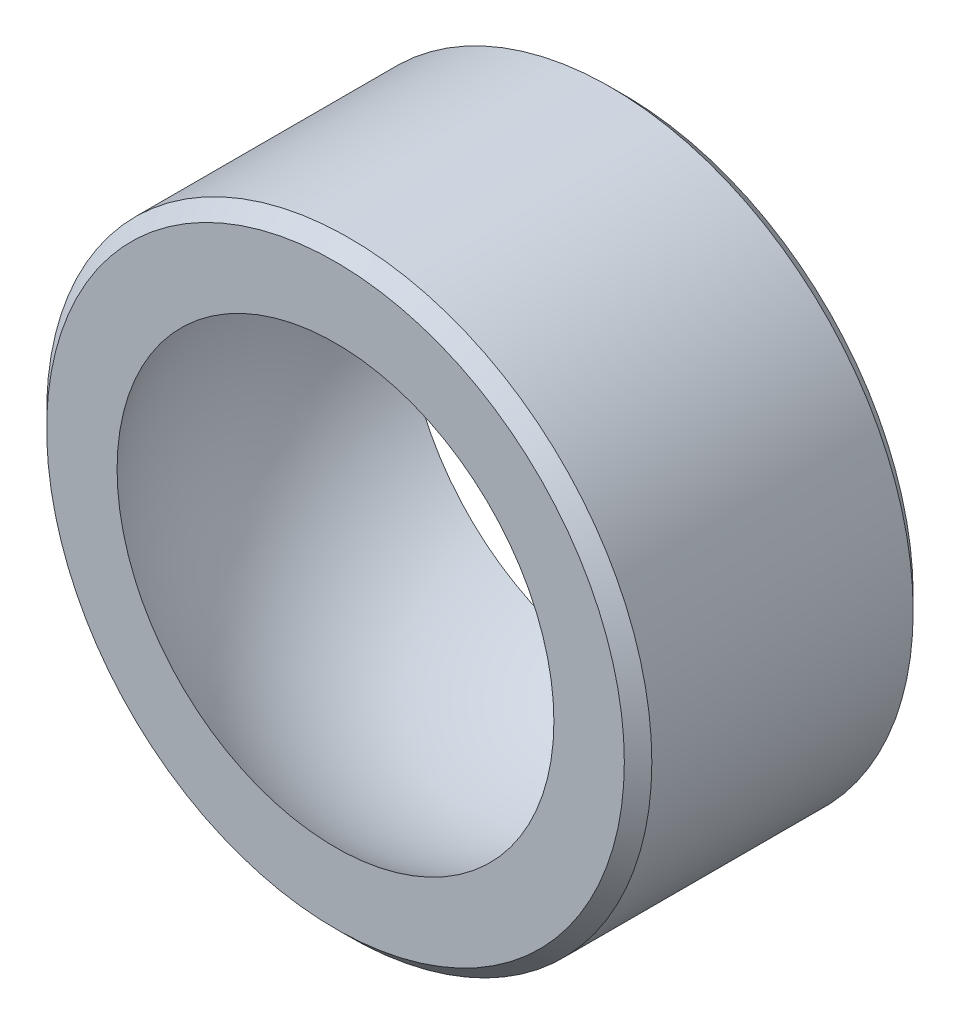
ISO-10303-21;
HEADER;
FILE_DESCRIPTION(('STEP AP214'),'2;1');
FILE_NAME('part.step','',(''),(''),'','','');
FILE_SCHEMA(('AUTOMOTIVE_DESIGN { 1 0 10303 214 1 1 1 1 }'));
ENDSEC;
DATA;
#1=APPLICATION_CONTEXT('core data for automotive mechanical design processes');
#2=APPLICATION_PROTOCOL_DEFINITION('international standard','automotive_design',2000,#1);
#3=PRODUCT_CONTEXT('',#1,'mechanical');
#4=PRODUCT('Part','Part','',(#3));
#5=PRODUCT_RELATED_PRODUCT_CATEGORY('part','',(#4));
#6=PRODUCT_DEFINITION_FORMATION('','',#4);
#7=PRODUCT_DEFINITION_CONTEXT('part definition',#1,'design');
#8=PRODUCT_DEFINITION('design','',#6,#7);
#9=PRODUCT_DEFINITION_SHAPE('','',#8);
#10=(LENGTH_UNIT() NAMED_UNIT(*) SI_UNIT(.MILLI.,.METRE.));
#11=(NAMED_UNIT(*) PLANE_ANGLE_UNIT() SI_UNIT($,.RADIAN.));
#12=(NAMED_UNIT(*) SI_UNIT($,.STERADIAN.) SOLID_ANGLE_UNIT());
#13=UNCERTAINTY_MEASURE_WITH_UNIT(LENGTH_MEASURE(1.E-05),#10,'distance_accuracy_value','');
#14=(GEOMETRIC_REPRESENTATION_CONTEXT(3) GLOBAL_UNCERTAINTY_ASSIGNED_CONTEXT((#13)) GLOBAL_UNIT_ASSIGNED_CONTEXT((#10,
#11,#12)) REPRESENTATION_CONTEXT('',''));
#15=CARTESIAN_POINT('',(0.,0.,0.));
#16=DIRECTION('',(0.,0.,1.));
#17=DIRECTION('',(1.,0.,0.));
#18=AXIS2_PLACEMENT_3D('',#15,#16,#17);
#19=CARTESIAN_POINT('',(0.,0.,5.25));
#20=DIRECTION('',(0.,0.,-1.));
#21=DIRECTION('',(-1.,0.,0.));
#22=AXIS2_PLACEMENT_3D('',#19,#20,#21);
#23=CYLINDRICAL_SURFACE('',#22,11.);
#24=CARTESIAN_POINT('',(0.,0.,-4.74999999999998));
#25=DIRECTION('',(0.,0.,1.));
#26=DIRECTION('',(1.,0.,0.));
#27=AXIS2_PLACEMENT_3D('',#24,#25,#26);
#28=CIRCLE('',#27,11.);
#29=CARTESIAN_POINT('',(11.,0.,-4.74999999999998));
#30=VERTEX_POINT('',#29);
#31=EDGE_CURVE('E51',#30,#30,#28,.T.);
#32=ORIENTED_EDGE('',*,*,#31,.T.);
#33=EDGE_LOOP('',(#32));
#34=FACE_BOUND('',#33,.T.);
#35=CARTESIAN_POINT('',(0.,0.,4.75000000000003));
#36=DIRECTION('',(0.,0.,1.));
#37=DIRECTION('',(1.,0.,0.));
#38=AXIS2_PLACEMENT_3D('',#35,#36,#37);
#39=CIRCLE('',#38,11.);
#40=CARTESIAN_POINT('',(11.,0.,4.75000000000003));
#41=VERTEX_POINT('',#40);
#42=EDGE_CURVE('E55',#41,#41,#39,.F.);
#43=ORIENTED_EDGE('',*,*,#42,.T.);
#44=EDGE_LOOP('',(#43));
#45=FACE_BOUND('',#44,.T.);
#46=ADVANCED_FACE('F39',(#34,#45),#23,.T.);
#47=CARTESIAN_POINT('',(0.,0.,5.25));
#48=DIRECTION('',(0.,0.,1.));
#49=DIRECTION('',(1.,0.,0.));
#50=AXIS2_PLACEMENT_3D('',#47,#48,#49);
#51=PLANE('',#50);
#52=CARTESIAN_POINT('',(0.,0.,5.25));
#53=DIRECTION('',(0.,0.,1.));
#54=DIRECTION('',(1.,0.,0.));
#55=AXIS2_PLACEMENT_3D('',#52,#53,#54);
#56=CIRCLE('',#55,10.5);
#57=CARTESIAN_POINT('',(10.5,0.,5.25));
#58=VERTEX_POINT('',#57);
#59=EDGE_CURVE('E10',#58,#58,#56,.T.);
#60=ORIENTED_EDGE('',*,*,#59,.T.);
#61=EDGE_LOOP('',(#60));
#62=FACE_BOUND('',#61,.T.);
#63=CARTESIAN_POINT('',(0.,0.,5.25));
#64=DIRECTION('',(0.,0.,1.));
#65=DIRECTION('',(1.,0.,0.));
#66=AXIS2_PLACEMENT_3D('',#63,#64,#65);
#67=CIRCLE('',#66,7.93977329651169);
#68=CARTESIAN_POINT('',(7.93977329651169,0.,5.25));
#69=VERTEX_POINT('',#68);
#70=EDGE_CURVE('E60',#69,#69,#67,.F.);
#71=ORIENTED_EDGE('',*,*,#70,.T.);
#72=EDGE_LOOP('',(#71));
#73=FACE_BOUND('',#72,.T.);
#74=ADVANCED_FACE('F67',(#62,#73),#51,.T.);
#75=CARTESIAN_POINT('',(0.,0.,-5.25));
#76=DIRECTION('',(0.,0.,1.));
#77=DIRECTION('',(1.,0.,0.));
#78=AXIS2_PLACEMENT_3D('',#75,#76,#77);
#79=PLANE('',#78);
#80=CARTESIAN_POINT('',(0.,0.,-5.25));
#81=DIRECTION('',(0.,0.,1.));
#82=DIRECTION('',(1.,0.,0.));
#83=AXIS2_PLACEMENT_3D('',#80,#81,#82);
#84=CIRCLE('',#83,10.5);
#85=CARTESIAN_POINT('',(10.5,0.,-5.25));
#86=VERTEX_POINT('',#85);
#87=EDGE_CURVE('E47',#86,#86,#84,.F.);
#88=ORIENTED_EDGE('',*,*,#87,.T.);
#89=EDGE_LOOP('',(#88));
#90=FACE_BOUND('',#89,.T.);
#91=CARTESIAN_POINT('',(0.,0.,-5.25));
#92=DIRECTION('',(0.,0.,1.));
#93=DIRECTION('',(1.,0.,0.));
#94=AXIS2_PLACEMENT_3D('',#91,#92,#93);
#95=CIRCLE('',#94,7.93977329651169);
#96=CARTESIAN_POINT('',(7.93977329651169,0.,-5.25));
#97=VERTEX_POINT('',#96);
#98=EDGE_CURVE('E61',#97,#97,#95,.F.);
#99=ORIENTED_EDGE('',*,*,#98,.F.);
#100=EDGE_LOOP('',(#99));
#101=FACE_BOUND('',#100,.T.);
#102=ADVANCED_FACE('F73',(#90,#101),#79,.F.);
#103=CARTESIAN_POINT('',(0.,0.,0.));
#104=DIRECTION('',(0.,0.,-1.));
#105=DIRECTION('',(0.,-1.,0.));
#106=AXIS2_PLACEMENT_3D('',#103,#104,#105);
#107=SPHERICAL_SURFACE('',#106,9.51853455107456);
#108=ORIENTED_EDGE('',*,*,#70,.F.);
#109=EDGE_LOOP('',(#108));
#110=FACE_BOUND('',#109,.T.);
#111=ORIENTED_EDGE('',*,*,#98,.T.);
#112=EDGE_LOOP('',(#111));
#113=FACE_BOUND('',#112,.T.);
#114=ADVANCED_FACE('F69',(#110,#113),#107,.F.);
#115=CARTESIAN_POINT('',(0.,0.,-4.74999999999998));
#116=DIRECTION('',(0.,0.,1.));
#117=DIRECTION('',(1.,0.,0.));
#118=AXIS2_PLACEMENT_3D('',#115,#116,#117);
#119=CONICAL_SURFACE('',#118,11.,0.785398163397448);
#120=ORIENTED_EDGE('',*,*,#87,.F.);
#121=EDGE_LOOP('',(#120));
#122=FACE_BOUND('',#121,.T.);
#123=ORIENTED_EDGE('',*,*,#31,.F.);
#124=EDGE_LOOP('',(#123));
#125=FACE_BOUND('',#124,.T.);
#126=ADVANCED_FACE('F72',(#122,#125),#119,.T.);
#127=CARTESIAN_POINT('',(0.,0.,5.25));
#128=DIRECTION('',(0.,0.,-1.));
#129=DIRECTION('',(-1.,0.,0.));
#130=AXIS2_PLACEMENT_3D('',#127,#128,#129);
#131=CONICAL_SURFACE('',#130,10.5,0.785398163397445);
#132=ORIENTED_EDGE('',*,*,#42,.F.);
#133=EDGE_LOOP('',(#132));
#134=FACE_BOUND('',#133,.T.);
#135=ORIENTED_EDGE('',*,*,#59,.F.);
#136=EDGE_LOOP('',(#135));
#137=FACE_BOUND('',#136,.T.);
#138=ADVANCED_FACE('F42',(#134,#137),#131,.T.);
#139=CLOSED_SHELL('',(#46,#74,#102,#114,#126,#138));
#140=MANIFOLD_SOLID_BREP('B2',#139);
#141=ADVANCED_BREP_SHAPE_REPRESENTATION('',(#18,#140),#14);
#142=SHAPE_DEFINITION_REPRESENTATION(#9,#141);
ENDSEC;
END-ISO-10303-21;
